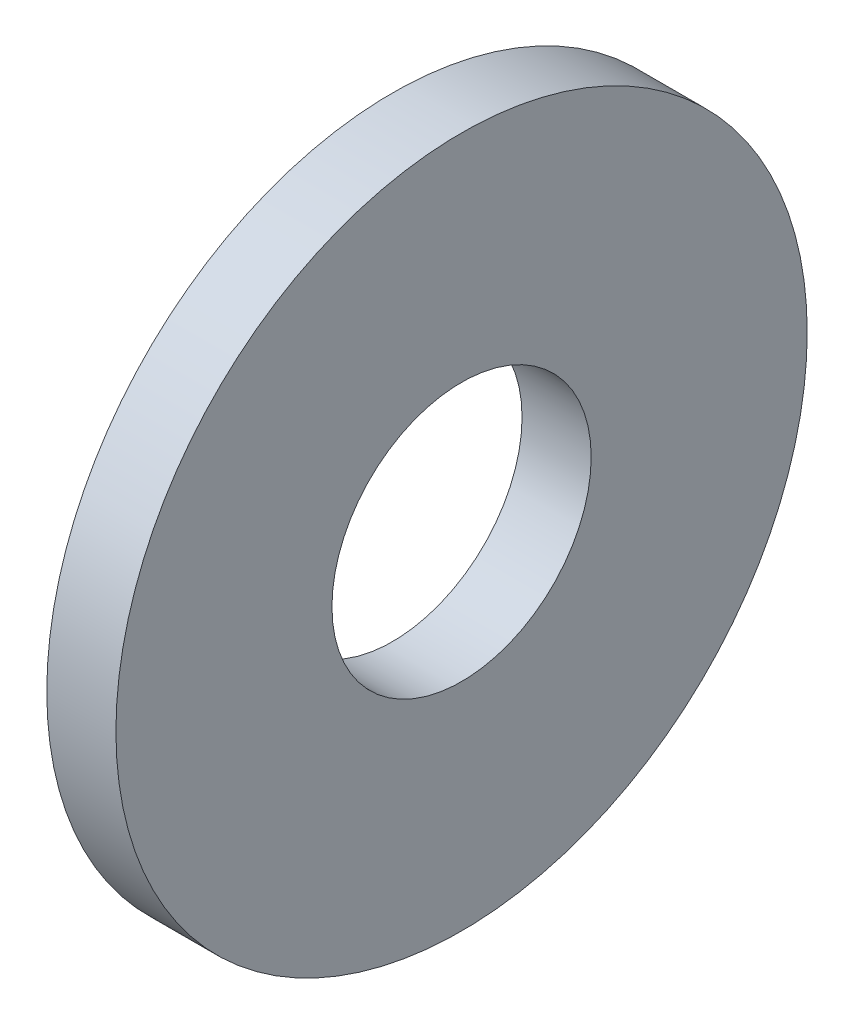
ISO-10303-21;
HEADER;
FILE_DESCRIPTION(('STEP AP214'),'2;1');
FILE_NAME('part.step','',(''),(''),'','','');
FILE_SCHEMA(('AUTOMOTIVE_DESIGN { 1 0 10303 214 1 1 1 1 }'));
ENDSEC;
DATA;
#1=APPLICATION_CONTEXT('core data for automotive mechanical design processes');
#2=APPLICATION_PROTOCOL_DEFINITION('international standard','automotive_design',2000,#1);
#3=PRODUCT_CONTEXT('',#1,'mechanical');
#4=PRODUCT('Part','Part','',(#3));
#5=PRODUCT_RELATED_PRODUCT_CATEGORY('part','',(#4));
#6=PRODUCT_DEFINITION_FORMATION('','',#4);
#7=PRODUCT_DEFINITION_CONTEXT('part definition',#1,'design');
#8=PRODUCT_DEFINITION('design','',#6,#7);
#9=PRODUCT_DEFINITION_SHAPE('','',#8);
#10=(LENGTH_UNIT() NAMED_UNIT(*) SI_UNIT(.MILLI.,.METRE.));
#11=(NAMED_UNIT(*) PLANE_ANGLE_UNIT() SI_UNIT($,.RADIAN.));
#12=(NAMED_UNIT(*) SI_UNIT($,.STERADIAN.) SOLID_ANGLE_UNIT());
#13=UNCERTAINTY_MEASURE_WITH_UNIT(LENGTH_MEASURE(1.E-05),#10,'distance_accuracy_value','');
#14=(GEOMETRIC_REPRESENTATION_CONTEXT(3) GLOBAL_UNCERTAINTY_ASSIGNED_CONTEXT((#13)) GLOBAL_UNIT_ASSIGNED_CONTEXT((#10,
#11,#12)) REPRESENTATION_CONTEXT('',''));
#15=CARTESIAN_POINT('',(0.,0.,0.));
#16=DIRECTION('',(0.,0.,1.));
#17=DIRECTION('',(1.,0.,0.));
#18=AXIS2_PLACEMENT_3D('',#15,#16,#17);
#19=CARTESIAN_POINT('',(0.6,0.,0.));
#20=DIRECTION('',(1.,0.,0.));
#21=DIRECTION('',(0.,0.,-1.));
#22=AXIS2_PLACEMENT_3D('',#19,#20,#21);
#23=PLANE('',#22);
#24=CARTESIAN_POINT('',(0.6,0.,0.));
#25=DIRECTION('',(1.,0.,0.));
#26=DIRECTION('',(0.,0.,-1.));
#27=AXIS2_PLACEMENT_3D('',#24,#25,#26);
#28=CIRCLE('',#27,3.);
#29=CARTESIAN_POINT('',(0.6,0.,-3.));
#30=VERTEX_POINT('',#29);
#31=EDGE_CURVE('E10',#30,#30,#28,.T.);
#32=ORIENTED_EDGE('',*,*,#31,.T.);
#33=EDGE_LOOP('',(#32));
#34=FACE_BOUND('',#33,.T.);
#35=CARTESIAN_POINT('',(0.6,0.,0.));
#36=DIRECTION('',(1.,0.,0.));
#37=DIRECTION('',(0.,0.,-1.));
#38=AXIS2_PLACEMENT_3D('',#35,#36,#37);
#39=CIRCLE('',#38,1.125);
#40=CARTESIAN_POINT('',(0.6,0.,-1.125));
#41=VERTEX_POINT('',#40);
#42=EDGE_CURVE('E42',#41,#41,#39,.T.);
#43=ORIENTED_EDGE('',*,*,#42,.F.);
#44=EDGE_LOOP('',(#43));
#45=FACE_BOUND('',#44,.T.);
#46=ADVANCED_FACE('F31',(#34,#45),#23,.T.);
#47=CARTESIAN_POINT('',(0.,0.,0.));
#48=DIRECTION('',(1.,0.,0.));
#49=DIRECTION('',(0.,0.,-1.));
#50=AXIS2_PLACEMENT_3D('',#47,#48,#49);
#51=PLANE('',#50);
#52=CARTESIAN_POINT('',(0.,0.,0.));
#53=DIRECTION('',(1.,0.,0.));
#54=DIRECTION('',(0.,0.,-1.));
#55=AXIS2_PLACEMENT_3D('',#52,#53,#54);
#56=CIRCLE('',#55,3.);
#57=CARTESIAN_POINT('',(0.,0.,-3.));
#58=VERTEX_POINT('',#57);
#59=EDGE_CURVE('E35',#58,#58,#56,.T.);
#60=ORIENTED_EDGE('',*,*,#59,.F.);
#61=EDGE_LOOP('',(#60));
#62=FACE_BOUND('',#61,.T.);
#63=CARTESIAN_POINT('',(0.,0.,0.));
#64=DIRECTION('',(1.,0.,0.));
#65=DIRECTION('',(0.,0.,-1.));
#66=AXIS2_PLACEMENT_3D('',#63,#64,#65);
#67=CIRCLE('',#66,1.125);
#68=CARTESIAN_POINT('',(0.,0.,-1.125));
#69=VERTEX_POINT('',#68);
#70=EDGE_CURVE('E44',#69,#69,#67,.T.);
#71=ORIENTED_EDGE('',*,*,#70,.T.);
#72=EDGE_LOOP('',(#71));
#73=FACE_BOUND('',#72,.T.);
#74=ADVANCED_FACE('F54',(#62,#73),#51,.F.);
#75=CARTESIAN_POINT('',(0.6,0.,0.));
#76=DIRECTION('',(-1.,0.,0.));
#77=DIRECTION('',(0.,0.,1.));
#78=AXIS2_PLACEMENT_3D('',#75,#76,#77);
#79=CYLINDRICAL_SURFACE('',#78,3.);
#80=ORIENTED_EDGE('',*,*,#31,.F.);
#81=EDGE_LOOP('',(#80));
#82=FACE_BOUND('',#81,.T.);
#83=ORIENTED_EDGE('',*,*,#59,.T.);
#84=EDGE_LOOP('',(#83));
#85=FACE_BOUND('',#84,.T.);
#86=ADVANCED_FACE('F33',(#82,#85),#79,.T.);
#87=CARTESIAN_POINT('',(0.6,0.,0.));
#88=DIRECTION('',(-1.,0.,0.));
#89=DIRECTION('',(0.,0.,1.));
#90=AXIS2_PLACEMENT_3D('',#87,#88,#89);
#91=CYLINDRICAL_SURFACE('',#90,1.125);
#92=ORIENTED_EDGE('',*,*,#42,.T.);
#93=EDGE_LOOP('',(#92));
#94=FACE_BOUND('',#93,.T.);
#95=ORIENTED_EDGE('',*,*,#70,.F.);
#96=EDGE_LOOP('',(#95));
#97=FACE_BOUND('',#96,.T.);
#98=ADVANCED_FACE('F50',(#94,#97),#91,.F.);
#99=CLOSED_SHELL('',(#46,#74,#86,#98));
#100=MANIFOLD_SOLID_BREP('B2',#99);
#101=ADVANCED_BREP_SHAPE_REPRESENTATION('',(#18,#100),#14);
#102=SHAPE_DEFINITION_REPRESENTATION(#9,#101);
ENDSEC;
END-ISO-10303-21;
